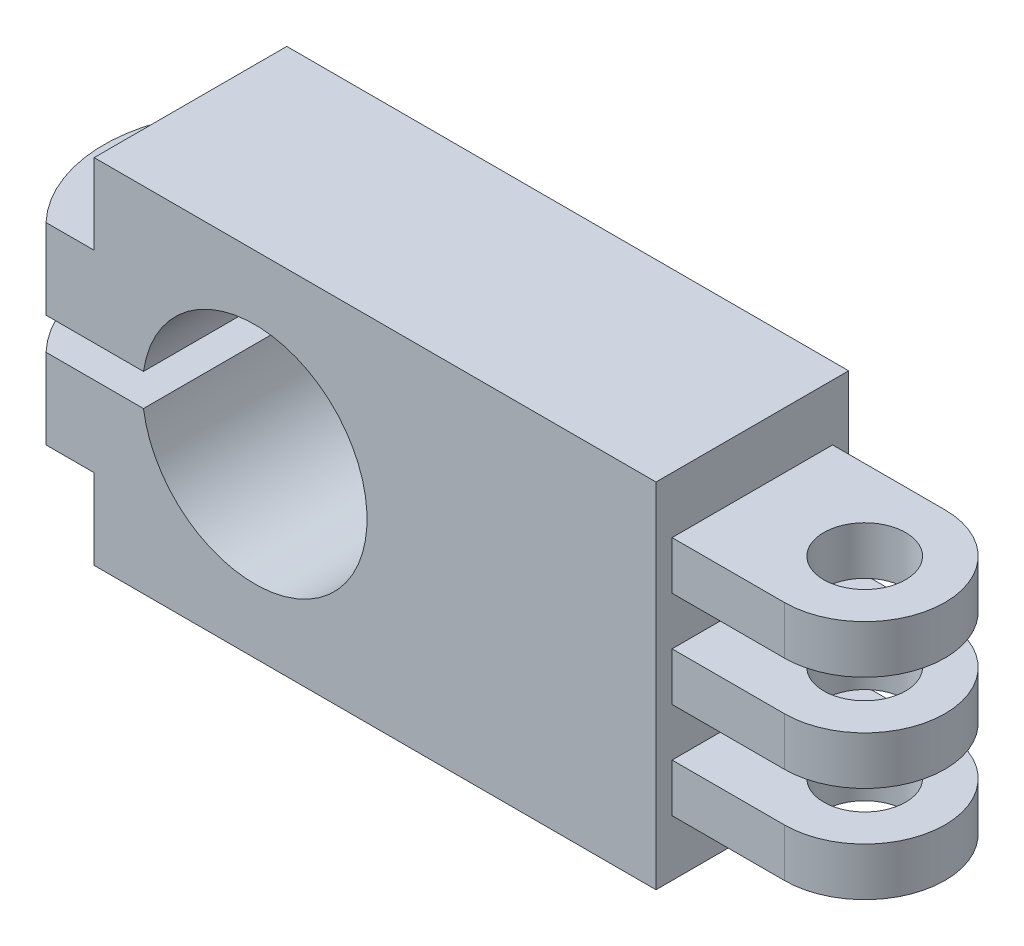
ISO-10303-21;
HEADER;
FILE_DESCRIPTION(('STEP AP214'),'2;1');
FILE_NAME('part.step','',(''),(''),'','','');
FILE_SCHEMA(('AUTOMOTIVE_DESIGN { 1 0 10303 214 1 1 1 1 }'));
ENDSEC;
DATA;
#1=APPLICATION_CONTEXT('core data for automotive mechanical design processes');
#2=APPLICATION_PROTOCOL_DEFINITION('international standard','automotive_design',2000,#1);
#3=PRODUCT_CONTEXT('',#1,'mechanical');
#4=PRODUCT('Part','Part','',(#3));
#5=PRODUCT_RELATED_PRODUCT_CATEGORY('part','',(#4));
#6=PRODUCT_DEFINITION_FORMATION('','',#4);
#7=PRODUCT_DEFINITION_CONTEXT('part definition',#1,'design');
#8=PRODUCT_DEFINITION('design','',#6,#7);
#9=PRODUCT_DEFINITION_SHAPE('','',#8);
#10=(LENGTH_UNIT() NAMED_UNIT(*) SI_UNIT(.MILLI.,.METRE.));
#11=(NAMED_UNIT(*) PLANE_ANGLE_UNIT() SI_UNIT($,.RADIAN.));
#12=(NAMED_UNIT(*) SI_UNIT($,.STERADIAN.) SOLID_ANGLE_UNIT());
#13=UNCERTAINTY_MEASURE_WITH_UNIT(LENGTH_MEASURE(1.E-05),#10,'distance_accuracy_value','');
#14=(GEOMETRIC_REPRESENTATION_CONTEXT(3) GLOBAL_UNCERTAINTY_ASSIGNED_CONTEXT((#13)) GLOBAL_UNIT_ASSIGNED_CONTEXT((#10,
#11,#12)) REPRESENTATION_CONTEXT('',''));
#15=CARTESIAN_POINT('',(0.,0.,0.));
#16=DIRECTION('',(0.,0.,1.));
#17=DIRECTION('',(1.,0.,0.));
#18=AXIS2_PLACEMENT_3D('',#15,#16,#17);
#19=CARTESIAN_POINT('',(-10.,-5.,12.));
#20=DIRECTION('',(0.,1.,0.));
#21=DIRECTION('',(0.,0.,1.));
#22=AXIS2_PLACEMENT_3D('',#19,#20,#21);
#23=PLANE('',#22);
#24=CARTESIAN_POINT('',(-2.5,-5.,6.));
#25=DIRECTION('',(0.,1.,0.));
#26=DIRECTION('',(0.,0.,1.));
#27=AXIS2_PLACEMENT_3D('',#24,#25,#26);
#28=CIRCLE('',#27,1.);
#29=CARTESIAN_POINT('',(-2.5,-5.,7.));
#30=VERTEX_POINT('',#29);
#31=EDGE_CURVE('E323',#30,#30,#28,.T.);
#32=ORIENTED_EDGE('',*,*,#31,.F.);
#33=EDGE_LOOP('',(#32));
#34=FACE_BOUND('',#33,.T.);
#35=CARTESIAN_POINT('',(3.31673634690876,-5.,6.));
#36=DIRECTION('',(0.,-1.,0.));
#37=DIRECTION('',(0.,0.,1.));
#38=AXIS2_PLACEMENT_3D('',#35,#36,#37);
#39=CIRCLE('',#38,8.71212706957137);
#40=CARTESIAN_POINT('',(-3.,-5.,12.));
#41=VERTEX_POINT('',#40);
#42=CARTESIAN_POINT('',(-3.,-5.,0.));
#43=VERTEX_POINT('',#42);
#44=EDGE_CURVE('E47',#41,#43,#39,.T.);
#45=ORIENTED_EDGE('',*,*,#44,.F.);
#46=DIRECTION('',(1.,0.,0.));
#47=VECTOR('',#46,1.);
#48=CARTESIAN_POINT('',(-10.,-5.,12.));
#49=LINE('',#48,#47);
#50=CARTESIAN_POINT('',(0.,-5.,12.));
#51=VERTEX_POINT('',#50);
#52=EDGE_CURVE('E202',#41,#51,#49,.T.);
#53=ORIENTED_EDGE('',*,*,#52,.T.);
#54=DIRECTION('',(0.,0.,-1.));
#55=VECTOR('',#54,1.);
#56=CARTESIAN_POINT('',(0.,-5.,12.));
#57=LINE('',#56,#55);
#58=CARTESIAN_POINT('',(0.,-5.,0.));
#59=VERTEX_POINT('',#58);
#60=EDGE_CURVE('E240',#51,#59,#57,.T.);
#61=ORIENTED_EDGE('',*,*,#60,.T.);
#62=DIRECTION('',(1.,0.,0.));
#63=VECTOR('',#62,1.);
#64=CARTESIAN_POINT('',(-10.,-5.,0.));
#65=LINE('',#64,#63);
#66=EDGE_CURVE('E204',#43,#59,#65,.T.);
#67=ORIENTED_EDGE('',*,*,#66,.F.);
#68=EDGE_LOOP('',(#45,#53,#61,#67));
#69=FACE_BOUND('',#68,.T.);
#70=ADVANCED_FACE('F33',(#34,#69),#23,.T.);
#71=CARTESIAN_POINT('',(-10.,-10.,12.));
#72=DIRECTION('',(0.,1.,0.));
#73=DIRECTION('',(0.,0.,1.));
#74=AXIS2_PLACEMENT_3D('',#71,#72,#73);
#75=PLANE('',#74);
#76=CARTESIAN_POINT('',(-2.5,-10.,6.));
#77=DIRECTION('',(0.,1.,0.));
#78=DIRECTION('',(0.,0.,1.));
#79=AXIS2_PLACEMENT_3D('',#76,#77,#78);
#80=CIRCLE('',#79,1.);
#81=CARTESIAN_POINT('',(-2.5,-10.,7.));
#82=VERTEX_POINT('',#81);
#83=EDGE_CURVE('E320',#82,#82,#80,.T.);
#84=ORIENTED_EDGE('',*,*,#83,.T.);
#85=EDGE_LOOP('',(#84));
#86=FACE_BOUND('',#85,.T.);
#87=DIRECTION('',(1.,0.,0.));
#88=VECTOR('',#87,1.);
#89=CARTESIAN_POINT('',(-10.,-10.,12.));
#90=LINE('',#89,#88);
#91=CARTESIAN_POINT('',(-3.,-10.,12.));
#92=VERTEX_POINT('',#91);
#93=CARTESIAN_POINT('',(3.07179676972449,-10.,12.));
#94=VERTEX_POINT('',#93);
#95=EDGE_CURVE('E238',#92,#94,#90,.T.);
#96=ORIENTED_EDGE('',*,*,#95,.F.);
#97=CARTESIAN_POINT('',(3.31673634690876,-10.,6.));
#98=DIRECTION('',(0.,1.,0.));
#99=DIRECTION('',(0.,0.,1.));
#100=AXIS2_PLACEMENT_3D('',#97,#98,#99);
#101=CIRCLE('',#100,8.71212706957137);
#102=CARTESIAN_POINT('',(-3.,-10.,0.));
#103=VERTEX_POINT('',#102);
#104=EDGE_CURVE('E193',#92,#103,#101,.F.);
#105=ORIENTED_EDGE('',*,*,#104,.T.);
#106=DIRECTION('',(1.,0.,0.));
#107=VECTOR('',#106,1.);
#108=CARTESIAN_POINT('',(-10.,-10.,0.));
#109=LINE('',#108,#107);
#110=CARTESIAN_POINT('',(3.07179676972449,-10.,0.));
#111=VERTEX_POINT('',#110);
#112=EDGE_CURVE('E212',#103,#111,#109,.T.);
#113=ORIENTED_EDGE('',*,*,#112,.T.);
#114=DIRECTION('',(0.,0.,1.));
#115=VECTOR('',#114,1.);
#116=CARTESIAN_POINT('',(3.07179676972449,-10.,-7.));
#117=LINE('',#116,#115);
#118=EDGE_CURVE('E312',#111,#94,#117,.T.);
#119=ORIENTED_EDGE('',*,*,#118,.T.);
#120=EDGE_LOOP('',(#96,#105,#113,#119));
#121=FACE_BOUND('',#120,.T.);
#122=ADVANCED_FACE('F298',(#86,#121),#75,.F.);
#123=CARTESIAN_POINT('',(0.,-12.,12.));
#124=DIRECTION('',(0.,-1.,0.));
#125=DIRECTION('',(0.,0.,-1.));
#126=AXIS2_PLACEMENT_3D('',#123,#124,#125);
#127=PLANE('',#126);
#128=CARTESIAN_POINT('',(-2.5,-12.,6.));
#129=DIRECTION('',(0.,-1.,0.));
#130=DIRECTION('',(0.,0.,-1.));
#131=AXIS2_PLACEMENT_3D('',#128,#129,#130);
#132=CIRCLE('',#131,1.);
#133=CARTESIAN_POINT('',(-2.5,-12.,5.));
#134=VERTEX_POINT('',#133);
#135=EDGE_CURVE('E317',#134,#134,#132,.T.);
#136=ORIENTED_EDGE('',*,*,#135,.T.);
#137=EDGE_LOOP('',(#136));
#138=FACE_BOUND('',#137,.T.);
#139=DIRECTION('',(-1.,0.,0.));
#140=VECTOR('',#139,1.);
#141=CARTESIAN_POINT('',(0.,-12.,0.));
#142=LINE('',#141,#140);
#143=CARTESIAN_POINT('',(3.07179676972449,-12.,0.));
#144=VERTEX_POINT('',#143);
#145=CARTESIAN_POINT('',(-3.,-12.,0.));
#146=VERTEX_POINT('',#145);
#147=EDGE_CURVE('E216',#144,#146,#142,.T.);
#148=ORIENTED_EDGE('',*,*,#147,.T.);
#149=CARTESIAN_POINT('',(3.31673634690876,-12.,6.));
#150=DIRECTION('',(0.,-1.,0.));
#151=DIRECTION('',(0.,0.,-1.));
#152=AXIS2_PLACEMENT_3D('',#149,#150,#151);
#153=CIRCLE('',#152,8.71212706957137);
#154=CARTESIAN_POINT('',(-3.,-12.,12.));
#155=VERTEX_POINT('',#154);
#156=EDGE_CURVE('E55',#146,#155,#153,.F.);
#157=ORIENTED_EDGE('',*,*,#156,.T.);
#158=DIRECTION('',(-1.,0.,0.));
#159=VECTOR('',#158,1.);
#160=CARTESIAN_POINT('',(0.,-12.,12.));
#161=LINE('',#160,#159);
#162=CARTESIAN_POINT('',(3.07179676972449,-12.,12.));
#163=VERTEX_POINT('',#162);
#164=EDGE_CURVE('E235',#163,#155,#161,.T.);
#165=ORIENTED_EDGE('',*,*,#164,.F.);
#166=DIRECTION('',(0.,0.,1.));
#167=VECTOR('',#166,1.);
#168=CARTESIAN_POINT('',(3.07179676972449,-12.,-7.));
#169=LINE('',#168,#167);
#170=EDGE_CURVE('E304',#163,#144,#169,.F.);
#171=ORIENTED_EDGE('',*,*,#170,.T.);
#172=EDGE_LOOP('',(#148,#157,#165,#171));
#173=FACE_BOUND('',#172,.T.);
#174=ADVANCED_FACE('F424',(#138,#173),#127,.F.);
#175=CARTESIAN_POINT('',(0.,-17.,12.));
#176=DIRECTION('',(0.,-1.,0.));
#177=DIRECTION('',(0.,0.,-1.));
#178=AXIS2_PLACEMENT_3D('',#175,#176,#177);
#179=PLANE('',#178);
#180=CARTESIAN_POINT('',(-2.5,-17.,6.));
#181=DIRECTION('',(0.,-1.,0.));
#182=DIRECTION('',(0.,0.,-1.));
#183=AXIS2_PLACEMENT_3D('',#180,#181,#182);
#184=CIRCLE('',#183,1.);
#185=CARTESIAN_POINT('',(-2.5,-17.,5.));
#186=VERTEX_POINT('',#185);
#187=EDGE_CURVE('E314',#186,#186,#184,.T.);
#188=ORIENTED_EDGE('',*,*,#187,.F.);
#189=EDGE_LOOP('',(#188));
#190=FACE_BOUND('',#189,.T.);
#191=CARTESIAN_POINT('',(3.31673634690876,-17.,6.));
#192=DIRECTION('',(0.,-1.,0.));
#193=DIRECTION('',(0.,0.,-1.));
#194=AXIS2_PLACEMENT_3D('',#191,#192,#193);
#195=CIRCLE('',#194,8.71212706957137);
#196=CARTESIAN_POINT('',(-3.,-17.,0.));
#197=VERTEX_POINT('',#196);
#198=CARTESIAN_POINT('',(-3.,-17.,12.));
#199=VERTEX_POINT('',#198);
#200=EDGE_CURVE('E306',#197,#199,#195,.F.);
#201=ORIENTED_EDGE('',*,*,#200,.F.);
#202=DIRECTION('',(-1.,0.,0.));
#203=VECTOR('',#202,1.);
#204=CARTESIAN_POINT('',(0.,-17.,0.));
#205=LINE('',#204,#203);
#206=CARTESIAN_POINT('',(0.,-17.,0.));
#207=VERTEX_POINT('',#206);
#208=EDGE_CURVE('E257',#207,#197,#205,.T.);
#209=ORIENTED_EDGE('',*,*,#208,.F.);
#210=DIRECTION('',(0.,0.,-1.));
#211=VECTOR('',#210,1.);
#212=CARTESIAN_POINT('',(0.,-17.,12.));
#213=LINE('',#212,#211);
#214=CARTESIAN_POINT('',(0.,-17.,12.));
#215=VERTEX_POINT('',#214);
#216=EDGE_CURVE('E262',#215,#207,#213,.T.);
#217=ORIENTED_EDGE('',*,*,#216,.F.);
#218=DIRECTION('',(-1.,0.,0.));
#219=VECTOR('',#218,1.);
#220=CARTESIAN_POINT('',(0.,-17.,12.));
#221=LINE('',#220,#219);
#222=EDGE_CURVE('E232',#215,#199,#221,.T.);
#223=ORIENTED_EDGE('',*,*,#222,.T.);
#224=EDGE_LOOP('',(#201,#209,#217,#223));
#225=FACE_BOUND('',#224,.T.);
#226=ADVANCED_FACE('F475',(#190,#225),#179,.T.);
#227=CARTESIAN_POINT('',(0.,-22.,12.));
#228=DIRECTION('',(-1.,0.,0.));
#229=DIRECTION('',(0.,0.,1.));
#230=AXIS2_PLACEMENT_3D('',#227,#228,#229);
#231=PLANE('',#230);
#232=DIRECTION('',(0.,1.,0.));
#233=VECTOR('',#232,1.);
#234=CARTESIAN_POINT('',(0.,-22.,0.));
#235=LINE('',#234,#233);
#236=CARTESIAN_POINT('',(0.,-22.,0.));
#237=VERTEX_POINT('',#236);
#238=EDGE_CURVE('E254',#237,#207,#235,.T.);
#239=ORIENTED_EDGE('',*,*,#238,.F.);
#240=DIRECTION('',(0.,0.,-1.));
#241=VECTOR('',#240,1.);
#242=CARTESIAN_POINT('',(0.,-22.,12.));
#243=LINE('',#242,#241);
#244=CARTESIAN_POINT('',(0.,-22.,12.));
#245=VERTEX_POINT('',#244);
#246=EDGE_CURVE('E265',#245,#237,#243,.T.);
#247=ORIENTED_EDGE('',*,*,#246,.F.);
#248=DIRECTION('',(0.,1.,0.));
#249=VECTOR('',#248,1.);
#250=CARTESIAN_POINT('',(0.,-22.,12.));
#251=LINE('',#250,#249);
#252=EDGE_CURVE('E229',#245,#215,#251,.T.);
#253=ORIENTED_EDGE('',*,*,#252,.T.);
#254=ORIENTED_EDGE('',*,*,#216,.T.);
#255=EDGE_LOOP('',(#239,#247,#253,#254));
#256=FACE_BOUND('',#255,.T.);
#257=ADVANCED_FACE('F479',(#256),#231,.T.);
#258=CARTESIAN_POINT('',(35.,-22.,12.));
#259=DIRECTION('',(0.,-1.,0.));
#260=DIRECTION('',(0.,0.,-1.));
#261=AXIS2_PLACEMENT_3D('',#258,#259,#260);
#262=PLANE('',#261);
#263=DIRECTION('',(-1.,0.,0.));
#264=VECTOR('',#263,1.);
#265=CARTESIAN_POINT('',(35.,-22.,0.));
#266=LINE('',#265,#264);
#267=CARTESIAN_POINT('',(35.,-22.,0.));
#268=VERTEX_POINT('',#267);
#269=EDGE_CURVE('E251',#268,#237,#266,.T.);
#270=ORIENTED_EDGE('',*,*,#269,.F.);
#271=DIRECTION('',(0.,0.,-1.));
#272=VECTOR('',#271,1.);
#273=CARTESIAN_POINT('',(35.,-22.,12.));
#274=LINE('',#273,#272);
#275=CARTESIAN_POINT('',(35.,-22.,12.));
#276=VERTEX_POINT('',#275);
#277=EDGE_CURVE('E267',#276,#268,#274,.T.);
#278=ORIENTED_EDGE('',*,*,#277,.F.);
#279=DIRECTION('',(-1.,0.,0.));
#280=VECTOR('',#279,1.);
#281=CARTESIAN_POINT('',(35.,-22.,12.));
#282=LINE('',#281,#280);
#283=EDGE_CURVE('E226',#276,#245,#282,.T.);
#284=ORIENTED_EDGE('',*,*,#283,.T.);
#285=ORIENTED_EDGE('',*,*,#246,.T.);
#286=EDGE_LOOP('',(#270,#278,#284,#285));
#287=FACE_BOUND('',#286,.T.);
#288=ADVANCED_FACE('F415',(#287),#262,.T.);
#289=CARTESIAN_POINT('',(35.,-18.5,12.));
#290=DIRECTION('',(1.,0.,0.));
#291=DIRECTION('',(0.,0.,-1.));
#292=AXIS2_PLACEMENT_3D('',#289,#290,#291);
#293=PLANE('',#292);
#294=ORIENTED_EDGE('',*,*,#277,.T.);
#295=DIRECTION('',(0.,-1.,0.));
#296=VECTOR('',#295,1.);
#297=CARTESIAN_POINT('',(35.,-18.5,0.));
#298=LINE('',#297,#296);
#299=CARTESIAN_POINT('',(35.,0.,0.));
#300=VERTEX_POINT('',#299);
#301=EDGE_CURVE('E248',#300,#268,#298,.T.);
#302=ORIENTED_EDGE('',*,*,#301,.F.);
#303=DIRECTION('',(0.,0.,-1.));
#304=VECTOR('',#303,1.);
#305=CARTESIAN_POINT('',(35.,0.,12.));
#306=LINE('',#305,#304);
#307=CARTESIAN_POINT('',(35.,0.,12.));
#308=VERTEX_POINT('',#307);
#309=EDGE_CURVE('E287',#308,#300,#306,.T.);
#310=ORIENTED_EDGE('',*,*,#309,.F.);
#311=DIRECTION('',(0.,-1.,0.));
#312=VECTOR('',#311,1.);
#313=CARTESIAN_POINT('',(35.,0.,12.));
#314=LINE('',#313,#312);
#315=EDGE_CURVE('E224',#308,#276,#314,.T.);
#316=ORIENTED_EDGE('',*,*,#315,.T.);
#317=EDGE_LOOP('',(#294,#302,#310,#316));
#318=FACE_BOUND('',#317,.T.);
#319=DIRECTION('',(0.,1.,0.));
#320=VECTOR('',#319,1.);
#321=CARTESIAN_POINT('',(35.,-22.5,1.));
#322=LINE('',#321,#320);
#323=CARTESIAN_POINT('',(35.,-18.5,1.));
#324=VERTEX_POINT('',#323);
#325=CARTESIAN_POINT('',(35.,-15.5,1.));
#326=VERTEX_POINT('',#325);
#327=EDGE_CURVE('E340',#324,#326,#322,.T.);
#328=ORIENTED_EDGE('',*,*,#327,.F.);
#329=DIRECTION('',(0.,0.,-1.));
#330=VECTOR('',#329,1.);
#331=CARTESIAN_POINT('',(35.,-18.5,12.));
#332=LINE('',#331,#330);
#333=CARTESIAN_POINT('',(35.,-18.5,11.));
#334=VERTEX_POINT('',#333);
#335=EDGE_CURVE('E269',#334,#324,#332,.T.);
#336=ORIENTED_EDGE('',*,*,#335,.F.);
#337=DIRECTION('',(0.,1.,0.));
#338=VECTOR('',#337,1.);
#339=CARTESIAN_POINT('',(35.,-22.5,11.));
#340=LINE('',#339,#338);
#341=CARTESIAN_POINT('',(35.,-15.5,11.));
#342=VERTEX_POINT('',#341);
#343=EDGE_CURVE('E345',#334,#342,#340,.T.);
#344=ORIENTED_EDGE('',*,*,#343,.T.);
#345=DIRECTION('',(0.,0.,-1.));
#346=VECTOR('',#345,1.);
#347=CARTESIAN_POINT('',(35.,-15.5,12.));
#348=LINE('',#347,#346);
#349=EDGE_CURVE('E272',#342,#326,#348,.T.);
#350=ORIENTED_EDGE('',*,*,#349,.T.);
#351=EDGE_LOOP('',(#328,#336,#344,#350));
#352=FACE_BOUND('',#351,.T.);
#353=CARTESIAN_POINT('',(35.,-12.5,1.));
#354=VERTEX_POINT('',#353);
#355=CARTESIAN_POINT('',(35.,-9.5,1.));
#356=VERTEX_POINT('',#355);
#357=EDGE_CURVE('E344',#354,#356,#322,.T.);
#358=ORIENTED_EDGE('',*,*,#357,.F.);
#359=DIRECTION('',(0.,0.,-1.));
#360=VECTOR('',#359,1.);
#361=CARTESIAN_POINT('',(35.,-12.5,12.));
#362=LINE('',#361,#360);
#363=CARTESIAN_POINT('',(35.,-12.5,11.));
#364=VERTEX_POINT('',#363);
#365=EDGE_CURVE('E275',#364,#354,#362,.T.);
#366=ORIENTED_EDGE('',*,*,#365,.F.);
#367=CARTESIAN_POINT('',(35.,-9.5,11.));
#368=VERTEX_POINT('',#367);
#369=EDGE_CURVE('E348',#364,#368,#340,.T.);
#370=ORIENTED_EDGE('',*,*,#369,.T.);
#371=DIRECTION('',(0.,0.,-1.));
#372=VECTOR('',#371,1.);
#373=CARTESIAN_POINT('',(35.,-9.5,12.));
#374=LINE('',#373,#372);
#375=EDGE_CURVE('E278',#368,#356,#374,.T.);
#376=ORIENTED_EDGE('',*,*,#375,.T.);
#377=EDGE_LOOP('',(#358,#366,#370,#376));
#378=FACE_BOUND('',#377,.T.);
#379=CARTESIAN_POINT('',(35.,-6.5,1.));
#380=VERTEX_POINT('',#379);
#381=CARTESIAN_POINT('',(35.,-3.5,1.));
#382=VERTEX_POINT('',#381);
#383=EDGE_CURVE('E342',#380,#382,#322,.T.);
#384=ORIENTED_EDGE('',*,*,#383,.F.);
#385=DIRECTION('',(0.,0.,-1.));
#386=VECTOR('',#385,1.);
#387=CARTESIAN_POINT('',(35.,-6.5,12.));
#388=LINE('',#387,#386);
#389=CARTESIAN_POINT('',(35.,-6.5,11.));
#390=VERTEX_POINT('',#389);
#391=EDGE_CURVE('E281',#390,#380,#388,.T.);
#392=ORIENTED_EDGE('',*,*,#391,.F.);
#393=CARTESIAN_POINT('',(35.,-3.5,11.));
#394=VERTEX_POINT('',#393);
#395=EDGE_CURVE('E346',#390,#394,#340,.T.);
#396=ORIENTED_EDGE('',*,*,#395,.T.);
#397=DIRECTION('',(0.,0.,-1.));
#398=VECTOR('',#397,1.);
#399=CARTESIAN_POINT('',(35.,-3.5,12.));
#400=LINE('',#399,#398);
#401=EDGE_CURVE('E284',#394,#382,#400,.T.);
#402=ORIENTED_EDGE('',*,*,#401,.T.);
#403=EDGE_LOOP('',(#384,#392,#396,#402));
#404=FACE_BOUND('',#403,.T.);
#405=ADVANCED_FACE('F405',(#318,#352,#378,#404),#293,.T.);
#406=CARTESIAN_POINT('',(47.,-18.5,12.));
#407=DIRECTION('',(0.,-1.,0.));
#408=DIRECTION('',(0.,0.,-1.));
#409=AXIS2_PLACEMENT_3D('',#406,#407,#408);
#410=PLANE('',#409);
#411=DIRECTION('',(-1.,0.,0.));
#412=VECTOR('',#411,1.);
#413=CARTESIAN_POINT('',(47.,-18.5,1.));
#414=LINE('',#413,#412);
#415=CARTESIAN_POINT('',(42.,-18.5,1.));
#416=VERTEX_POINT('',#415);
#417=EDGE_CURVE('E370',#416,#324,#414,.T.);
#418=ORIENTED_EDGE('',*,*,#417,.F.);
#419=CARTESIAN_POINT('',(42.,-18.5,6.));
#420=DIRECTION('',(0.,-1.,0.));
#421=DIRECTION('',(0.,0.,-1.));
#422=AXIS2_PLACEMENT_3D('',#419,#420,#421);
#423=CIRCLE('',#422,5.);
#424=CARTESIAN_POINT('',(42.,-18.5,11.));
#425=VERTEX_POINT('',#424);
#426=EDGE_CURVE('E380',#425,#416,#423,.F.);
#427=ORIENTED_EDGE('',*,*,#426,.F.);
#428=DIRECTION('',(1.,0.,0.));
#429=VECTOR('',#428,1.);
#430=CARTESIAN_POINT('',(47.,-18.5,11.));
#431=LINE('',#430,#429);
#432=EDGE_CURVE('E360',#334,#425,#431,.T.);
#433=ORIENTED_EDGE('',*,*,#432,.F.);
#434=ORIENTED_EDGE('',*,*,#335,.T.);
#435=EDGE_LOOP('',(#418,#427,#433,#434));
#436=FACE_BOUND('',#435,.T.);
#437=CARTESIAN_POINT('',(42.,-18.5,6.));
#438=DIRECTION('',(0.,-1.,0.));
#439=DIRECTION('',(0.,0.,-1.));
#440=AXIS2_PLACEMENT_3D('',#437,#438,#439);
#441=CIRCLE('',#440,2.55);
#442=CARTESIAN_POINT('',(42.,-18.5,3.45));
#443=VERTEX_POINT('',#442);
#444=EDGE_CURVE('E219',#443,#443,#441,.T.);
#445=ORIENTED_EDGE('',*,*,#444,.F.);
#446=EDGE_LOOP('',(#445));
#447=FACE_BOUND('',#446,.T.);
#448=ADVANCED_FACE('F402',(#436,#447),#410,.T.);
#449=CARTESIAN_POINT('',(35.,-15.5,12.));
#450=DIRECTION('',(0.,1.,0.));
#451=DIRECTION('',(0.,0.,1.));
#452=AXIS2_PLACEMENT_3D('',#449,#450,#451);
#453=PLANE('',#452);
#454=DIRECTION('',(1.,0.,0.));
#455=VECTOR('',#454,1.);
#456=CARTESIAN_POINT('',(35.,-15.5,1.));
#457=LINE('',#456,#455);
#458=CARTESIAN_POINT('',(42.,-15.5,1.));
#459=VERTEX_POINT('',#458);
#460=EDGE_CURVE('E368',#326,#459,#457,.T.);
#461=ORIENTED_EDGE('',*,*,#460,.F.);
#462=ORIENTED_EDGE('',*,*,#349,.F.);
#463=DIRECTION('',(-1.,0.,0.));
#464=VECTOR('',#463,1.);
#465=CARTESIAN_POINT('',(35.,-15.5,11.));
#466=LINE('',#465,#464);
#467=CARTESIAN_POINT('',(42.,-15.5,11.));
#468=VERTEX_POINT('',#467);
#469=EDGE_CURVE('E358',#468,#342,#466,.T.);
#470=ORIENTED_EDGE('',*,*,#469,.F.);
#471=CARTESIAN_POINT('',(42.,-15.5,6.));
#472=DIRECTION('',(0.,1.,0.));
#473=DIRECTION('',(0.,0.,1.));
#474=AXIS2_PLACEMENT_3D('',#471,#472,#473);
#475=CIRCLE('',#474,5.);
#476=EDGE_CURVE('E378',#459,#468,#475,.F.);
#477=ORIENTED_EDGE('',*,*,#476,.F.);
#478=EDGE_LOOP('',(#461,#462,#470,#477));
#479=FACE_BOUND('',#478,.T.);
#480=CARTESIAN_POINT('',(42.,-15.5,6.));
#481=DIRECTION('',(0.,1.,0.));
#482=DIRECTION('',(0.,0.,1.));
#483=AXIS2_PLACEMENT_3D('',#480,#481,#482);
#484=CIRCLE('',#483,2.55);
#485=CARTESIAN_POINT('',(42.,-15.5,8.55));
#486=VERTEX_POINT('',#485);
#487=EDGE_CURVE('E393',#486,#486,#484,.T.);
#488=ORIENTED_EDGE('',*,*,#487,.F.);
#489=EDGE_LOOP('',(#488));
#490=FACE_BOUND('',#489,.T.);
#491=ADVANCED_FACE('F404',(#479,#490),#453,.T.);
#492=CARTESIAN_POINT('',(47.,-12.5,12.));
#493=DIRECTION('',(0.,-1.,0.));
#494=DIRECTION('',(0.,0.,-1.));
#495=AXIS2_PLACEMENT_3D('',#492,#493,#494);
#496=PLANE('',#495);
#497=DIRECTION('',(-1.,0.,0.));
#498=VECTOR('',#497,1.);
#499=CARTESIAN_POINT('',(47.,-12.5,1.));
#500=LINE('',#499,#498);
#501=CARTESIAN_POINT('',(42.,-12.5,1.));
#502=VERTEX_POINT('',#501);
#503=EDGE_CURVE('E366',#502,#354,#500,.T.);
#504=ORIENTED_EDGE('',*,*,#503,.F.);
#505=CARTESIAN_POINT('',(42.,-12.5,6.));
#506=DIRECTION('',(0.,-1.,0.));
#507=DIRECTION('',(0.,0.,-1.));
#508=AXIS2_PLACEMENT_3D('',#505,#506,#507);
#509=CIRCLE('',#508,5.);
#510=CARTESIAN_POINT('',(42.,-12.5,11.));
#511=VERTEX_POINT('',#510);
#512=EDGE_CURVE('E376',#511,#502,#509,.F.);
#513=ORIENTED_EDGE('',*,*,#512,.F.);
#514=DIRECTION('',(1.,0.,0.));
#515=VECTOR('',#514,1.);
#516=CARTESIAN_POINT('',(47.,-12.5,11.));
#517=LINE('',#516,#515);
#518=EDGE_CURVE('E356',#364,#511,#517,.T.);
#519=ORIENTED_EDGE('',*,*,#518,.F.);
#520=ORIENTED_EDGE('',*,*,#365,.T.);
#521=EDGE_LOOP('',(#504,#513,#519,#520));
#522=FACE_BOUND('',#521,.T.);
#523=CARTESIAN_POINT('',(42.,-12.5,6.));
#524=DIRECTION('',(0.,-1.,0.));
#525=DIRECTION('',(0.,0.,-1.));
#526=AXIS2_PLACEMENT_3D('',#523,#524,#525);
#527=CIRCLE('',#526,2.55);
#528=CARTESIAN_POINT('',(42.,-12.5,3.45));
#529=VERTEX_POINT('',#528);
#530=EDGE_CURVE('E391',#529,#529,#527,.T.);
#531=ORIENTED_EDGE('',*,*,#530,.F.);
#532=EDGE_LOOP('',(#531));
#533=FACE_BOUND('',#532,.T.);
#534=ADVANCED_FACE('F412',(#522,#533),#496,.T.);
#535=CARTESIAN_POINT('',(35.,-9.5,12.));
#536=DIRECTION('',(0.,1.,0.));
#537=DIRECTION('',(0.,0.,1.));
#538=AXIS2_PLACEMENT_3D('',#535,#536,#537);
#539=PLANE('',#538);
#540=DIRECTION('',(1.,0.,0.));
#541=VECTOR('',#540,1.);
#542=CARTESIAN_POINT('',(35.,-9.5,1.));
#543=LINE('',#542,#541);
#544=CARTESIAN_POINT('',(42.,-9.5,1.));
#545=VERTEX_POINT('',#544);
#546=EDGE_CURVE('E364',#356,#545,#543,.T.);
#547=ORIENTED_EDGE('',*,*,#546,.F.);
#548=ORIENTED_EDGE('',*,*,#375,.F.);
#549=DIRECTION('',(-1.,0.,0.));
#550=VECTOR('',#549,1.);
#551=CARTESIAN_POINT('',(35.,-9.5,11.));
#552=LINE('',#551,#550);
#553=CARTESIAN_POINT('',(42.,-9.5,11.));
#554=VERTEX_POINT('',#553);
#555=EDGE_CURVE('E354',#554,#368,#552,.T.);
#556=ORIENTED_EDGE('',*,*,#555,.F.);
#557=CARTESIAN_POINT('',(42.,-9.5,6.));
#558=DIRECTION('',(0.,1.,0.));
#559=DIRECTION('',(0.,0.,1.));
#560=AXIS2_PLACEMENT_3D('',#557,#558,#559);
#561=CIRCLE('',#560,5.);
#562=EDGE_CURVE('E374',#545,#554,#561,.F.);
#563=ORIENTED_EDGE('',*,*,#562,.F.);
#564=EDGE_LOOP('',(#547,#548,#556,#563));
#565=FACE_BOUND('',#564,.T.);
#566=CARTESIAN_POINT('',(42.,-9.5,6.));
#567=DIRECTION('',(0.,1.,0.));
#568=DIRECTION('',(0.,0.,1.));
#569=AXIS2_PLACEMENT_3D('',#566,#567,#568);
#570=CIRCLE('',#569,2.55);
#571=CARTESIAN_POINT('',(42.,-9.5,8.55));
#572=VERTEX_POINT('',#571);
#573=EDGE_CURVE('E388',#572,#572,#570,.T.);
#574=ORIENTED_EDGE('',*,*,#573,.F.);
#575=EDGE_LOOP('',(#574));
#576=FACE_BOUND('',#575,.T.);
#577=ADVANCED_FACE('F512',(#565,#576),#539,.T.);
#578=CARTESIAN_POINT('',(47.,-6.5,12.));
#579=DIRECTION('',(0.,-1.,0.));
#580=DIRECTION('',(0.,0.,-1.));
#581=AXIS2_PLACEMENT_3D('',#578,#579,#580);
#582=PLANE('',#581);
#583=DIRECTION('',(-1.,0.,0.));
#584=VECTOR('',#583,1.);
#585=CARTESIAN_POINT('',(47.,-6.5,1.));
#586=LINE('',#585,#584);
#587=CARTESIAN_POINT('',(42.,-6.5,1.));
#588=VERTEX_POINT('',#587);
#589=EDGE_CURVE('E362',#588,#380,#586,.T.);
#590=ORIENTED_EDGE('',*,*,#589,.F.);
#591=CARTESIAN_POINT('',(42.,-6.5,6.));
#592=DIRECTION('',(0.,-1.,0.));
#593=DIRECTION('',(0.,0.,-1.));
#594=AXIS2_PLACEMENT_3D('',#591,#592,#593);
#595=CIRCLE('',#594,5.);
#596=CARTESIAN_POINT('',(42.,-6.5,11.));
#597=VERTEX_POINT('',#596);
#598=EDGE_CURVE('E372',#597,#588,#595,.F.);
#599=ORIENTED_EDGE('',*,*,#598,.F.);
#600=DIRECTION('',(1.,0.,0.));
#601=VECTOR('',#600,1.);
#602=CARTESIAN_POINT('',(47.,-6.5,11.));
#603=LINE('',#602,#601);
#604=EDGE_CURVE('E352',#390,#597,#603,.T.);
#605=ORIENTED_EDGE('',*,*,#604,.F.);
#606=ORIENTED_EDGE('',*,*,#391,.T.);
#607=EDGE_LOOP('',(#590,#599,#605,#606));
#608=FACE_BOUND('',#607,.T.);
#609=CARTESIAN_POINT('',(42.,-6.5,6.));
#610=DIRECTION('',(0.,-1.,0.));
#611=DIRECTION('',(0.,0.,-1.));
#612=AXIS2_PLACEMENT_3D('',#609,#610,#611);
#613=CIRCLE('',#612,2.55);
#614=CARTESIAN_POINT('',(42.,-6.5,3.45));
#615=VERTEX_POINT('',#614);
#616=EDGE_CURVE('E385',#615,#615,#613,.T.);
#617=ORIENTED_EDGE('',*,*,#616,.F.);
#618=EDGE_LOOP('',(#617));
#619=FACE_BOUND('',#618,.T.);
#620=ADVANCED_FACE('F508',(#608,#619),#582,.T.);
#621=CARTESIAN_POINT('',(35.,-3.5,12.));
#622=DIRECTION('',(0.,1.,0.));
#623=DIRECTION('',(0.,0.,1.));
#624=AXIS2_PLACEMENT_3D('',#621,#622,#623);
#625=PLANE('',#624);
#626=DIRECTION('',(1.,0.,0.));
#627=VECTOR('',#626,1.);
#628=CARTESIAN_POINT('',(42.,-3.5,1.));
#629=LINE('',#628,#627);
#630=CARTESIAN_POINT('',(42.,-3.5,1.));
#631=VERTEX_POINT('',#630);
#632=EDGE_CURVE('E332',#382,#631,#629,.T.);
#633=ORIENTED_EDGE('',*,*,#632,.F.);
#634=ORIENTED_EDGE('',*,*,#401,.F.);
#635=DIRECTION('',(-1.,0.,0.));
#636=VECTOR('',#635,1.);
#637=CARTESIAN_POINT('',(35.,-3.5,11.));
#638=LINE('',#637,#636);
#639=CARTESIAN_POINT('',(42.,-3.5,11.));
#640=VERTEX_POINT('',#639);
#641=EDGE_CURVE('E329',#640,#394,#638,.T.);
#642=ORIENTED_EDGE('',*,*,#641,.F.);
#643=CARTESIAN_POINT('',(42.,-3.5,6.));
#644=DIRECTION('',(0.,-1.,0.));
#645=DIRECTION('',(0.,0.,1.));
#646=AXIS2_PLACEMENT_3D('',#643,#644,#645);
#647=CIRCLE('',#646,5.);
#648=EDGE_CURVE('E326',#631,#640,#647,.T.);
#649=ORIENTED_EDGE('',*,*,#648,.F.);
#650=EDGE_LOOP('',(#633,#634,#642,#649));
#651=FACE_BOUND('',#650,.T.);
#652=CARTESIAN_POINT('',(42.,-3.5,6.));
#653=DIRECTION('',(0.,1.,0.));
#654=DIRECTION('',(0.,0.,1.));
#655=AXIS2_PLACEMENT_3D('',#652,#653,#654);
#656=CIRCLE('',#655,2.55);
#657=CARTESIAN_POINT('',(42.,-3.5,8.55));
#658=VERTEX_POINT('',#657);
#659=EDGE_CURVE('E382',#658,#658,#656,.T.);
#660=ORIENTED_EDGE('',*,*,#659,.F.);
#661=EDGE_LOOP('',(#660));
#662=FACE_BOUND('',#661,.T.);
#663=ADVANCED_FACE('F503',(#651,#662),#625,.T.);
#664=CARTESIAN_POINT('',(0.,0.,12.));
#665=DIRECTION('',(0.,1.,0.));
#666=DIRECTION('',(0.,0.,1.));
#667=AXIS2_PLACEMENT_3D('',#664,#665,#666);
#668=PLANE('',#667);
#669=DIRECTION('',(1.,0.,0.));
#670=VECTOR('',#669,1.);
#671=CARTESIAN_POINT('',(0.,0.,0.));
#672=LINE('',#671,#670);
#673=CARTESIAN_POINT('',(0.,0.,0.));
#674=VERTEX_POINT('',#673);
#675=EDGE_CURVE('E245',#674,#300,#672,.T.);
#676=ORIENTED_EDGE('',*,*,#675,.F.);
#677=DIRECTION('',(0.,0.,-1.));
#678=VECTOR('',#677,1.);
#679=CARTESIAN_POINT('',(0.,0.,12.));
#680=LINE('',#679,#678);
#681=CARTESIAN_POINT('',(0.,0.,12.));
#682=VERTEX_POINT('',#681);
#683=EDGE_CURVE('E290',#682,#674,#680,.T.);
#684=ORIENTED_EDGE('',*,*,#683,.F.);
#685=DIRECTION('',(1.,0.,0.));
#686=VECTOR('',#685,1.);
#687=CARTESIAN_POINT('',(0.,0.,12.));
#688=LINE('',#687,#686);
#689=EDGE_CURVE('E214',#682,#308,#688,.T.);
#690=ORIENTED_EDGE('',*,*,#689,.T.);
#691=ORIENTED_EDGE('',*,*,#309,.T.);
#692=EDGE_LOOP('',(#676,#684,#690,#691));
#693=FACE_BOUND('',#692,.T.);
#694=ADVANCED_FACE('F496',(#693),#668,.T.);
#695=CARTESIAN_POINT('',(0.,-5.,12.));
#696=DIRECTION('',(-1.,0.,0.));
#697=DIRECTION('',(0.,-1.,0.));
#698=AXIS2_PLACEMENT_3D('',#695,#696,#697);
#699=PLANE('',#698);
#700=DIRECTION('',(0.,1.,0.));
#701=VECTOR('',#700,1.);
#702=CARTESIAN_POINT('',(0.,-5.,0.));
#703=LINE('',#702,#701);
#704=EDGE_CURVE('E242',#59,#674,#703,.T.);
#705=ORIENTED_EDGE('',*,*,#704,.F.);
#706=ORIENTED_EDGE('',*,*,#60,.F.);
#707=DIRECTION('',(0.,1.,0.));
#708=VECTOR('',#707,1.);
#709=CARTESIAN_POINT('',(0.,-5.,12.));
#710=LINE('',#709,#708);
#711=EDGE_CURVE('E211',#51,#682,#710,.T.);
#712=ORIENTED_EDGE('',*,*,#711,.T.);
#713=ORIENTED_EDGE('',*,*,#683,.T.);
#714=EDGE_LOOP('',(#705,#706,#712,#713));
#715=FACE_BOUND('',#714,.T.);
#716=ADVANCED_FACE('F470',(#715),#699,.T.);
#717=CARTESIAN_POINT('',(0.,0.,12.));
#718=DIRECTION('',(0.,0.,1.));
#719=DIRECTION('',(1.,0.,0.));
#720=AXIS2_PLACEMENT_3D('',#717,#718,#719);
#721=PLANE('',#720);
#722=DIRECTION('',(0.,1.,0.));
#723=VECTOR('',#722,1.);
#724=CARTESIAN_POINT('',(-3.,-24.,12.));
#725=LINE('',#724,#723);
#726=EDGE_CURVE('E197',#199,#155,#725,.T.);
#727=ORIENTED_EDGE('',*,*,#726,.F.);
#728=ORIENTED_EDGE('',*,*,#222,.F.);
#729=ORIENTED_EDGE('',*,*,#252,.F.);
#730=ORIENTED_EDGE('',*,*,#283,.F.);
#731=ORIENTED_EDGE('',*,*,#315,.F.);
#732=ORIENTED_EDGE('',*,*,#689,.F.);
#733=ORIENTED_EDGE('',*,*,#711,.F.);
#734=ORIENTED_EDGE('',*,*,#52,.F.);
#735=EDGE_CURVE('E190',#92,#41,#725,.T.);
#736=ORIENTED_EDGE('',*,*,#735,.F.);
#737=ORIENTED_EDGE('',*,*,#95,.T.);
#738=CARTESIAN_POINT('',(10.,-11.,12.));
#739=DIRECTION('',(0.,0.,1.));
#740=DIRECTION('',(1.,0.,0.));
#741=AXIS2_PLACEMENT_3D('',#738,#739,#740);
#742=CIRCLE('',#741,7.);
#743=EDGE_CURVE('E301',#163,#94,#742,.T.);
#744=ORIENTED_EDGE('',*,*,#743,.F.);
#745=ORIENTED_EDGE('',*,*,#164,.T.);
#746=EDGE_LOOP('',(#727,#728,#729,#730,#731,#732,#733,#734,#736,#737,#744,#745));
#747=FACE_BOUND('',#746,.T.);
#748=ADVANCED_FACE('F208',(#747),#721,.T.);
#749=CARTESIAN_POINT('',(0.,0.,0.));
#750=DIRECTION('',(0.,0.,1.));
#751=DIRECTION('',(1.,0.,0.));
#752=AXIS2_PLACEMENT_3D('',#749,#750,#751);
#753=PLANE('',#752);
#754=ORIENTED_EDGE('',*,*,#208,.T.);
#755=DIRECTION('',(0.,1.,0.));
#756=VECTOR('',#755,1.);
#757=CARTESIAN_POINT('',(-3.,0.,0.));
#758=LINE('',#757,#756);
#759=EDGE_CURVE('E11',#197,#146,#758,.T.);
#760=ORIENTED_EDGE('',*,*,#759,.T.);
#761=ORIENTED_EDGE('',*,*,#147,.F.);
#762=CARTESIAN_POINT('',(10.,-11.,0.));
#763=DIRECTION('',(0.,0.,1.));
#764=DIRECTION('',(1.,0.,0.));
#765=AXIS2_PLACEMENT_3D('',#762,#763,#764);
#766=CIRCLE('',#765,7.);
#767=EDGE_CURVE('E264',#144,#111,#766,.T.);
#768=ORIENTED_EDGE('',*,*,#767,.T.);
#769=ORIENTED_EDGE('',*,*,#112,.F.);
#770=EDGE_CURVE('E36',#103,#43,#758,.T.);
#771=ORIENTED_EDGE('',*,*,#770,.T.);
#772=ORIENTED_EDGE('',*,*,#66,.T.);
#773=ORIENTED_EDGE('',*,*,#704,.T.);
#774=ORIENTED_EDGE('',*,*,#675,.T.);
#775=ORIENTED_EDGE('',*,*,#301,.T.);
#776=ORIENTED_EDGE('',*,*,#269,.T.);
#777=ORIENTED_EDGE('',*,*,#238,.T.);
#778=EDGE_LOOP('',(#754,#760,#761,#768,#769,#771,#772,#773,#774,#775,#776,#777));
#779=FACE_BOUND('',#778,.T.);
#780=ADVANCED_FACE('F296',(#779),#753,.F.);
#781=CARTESIAN_POINT('',(42.,-22.5,6.));
#782=DIRECTION('',(0.,1.,0.));
#783=DIRECTION('',(0.,0.,1.));
#784=AXIS2_PLACEMENT_3D('',#781,#782,#783);
#785=CYLINDRICAL_SURFACE('',#784,2.55);
#786=ORIENTED_EDGE('',*,*,#616,.T.);
#787=EDGE_LOOP('',(#786));
#788=FACE_BOUND('',#787,.T.);
#789=ORIENTED_EDGE('',*,*,#659,.T.);
#790=EDGE_LOOP('',(#789));
#791=FACE_BOUND('',#790,.T.);
#792=ADVANCED_FACE('F463',(#788,#791),#785,.F.);
#793=ORIENTED_EDGE('',*,*,#530,.T.);
#794=EDGE_LOOP('',(#793));
#795=FACE_BOUND('',#794,.T.);
#796=ORIENTED_EDGE('',*,*,#573,.T.);
#797=EDGE_LOOP('',(#796));
#798=FACE_BOUND('',#797,.T.);
#799=ADVANCED_FACE('F466',(#795,#798),#785,.F.);
#800=ORIENTED_EDGE('',*,*,#444,.T.);
#801=EDGE_LOOP('',(#800));
#802=FACE_BOUND('',#801,.T.);
#803=ORIENTED_EDGE('',*,*,#487,.T.);
#804=EDGE_LOOP('',(#803));
#805=FACE_BOUND('',#804,.T.);
#806=ADVANCED_FACE('F400',(#802,#805),#785,.F.);
#807=CARTESIAN_POINT('',(42.,-22.5,1.));
#808=DIRECTION('',(0.,0.,1.));
#809=DIRECTION('',(1.,0.,0.));
#810=AXIS2_PLACEMENT_3D('',#807,#808,#809);
#811=PLANE('',#810);
#812=ORIENTED_EDGE('',*,*,#417,.T.);
#813=ORIENTED_EDGE('',*,*,#327,.T.);
#814=ORIENTED_EDGE('',*,*,#460,.T.);
#815=DIRECTION('',(0.,1.,0.));
#816=VECTOR('',#815,1.);
#817=CARTESIAN_POINT('',(42.,-22.5,1.));
#818=LINE('',#817,#816);
#819=EDGE_CURVE('E341',#416,#459,#818,.T.);
#820=ORIENTED_EDGE('',*,*,#819,.F.);
#821=EDGE_LOOP('',(#812,#813,#814,#820));
#822=FACE_BOUND('',#821,.T.);
#823=ADVANCED_FACE('F451',(#822),#811,.F.);
#824=CARTESIAN_POINT('',(35.,-22.5,11.));
#825=DIRECTION('',(0.,0.,-1.));
#826=DIRECTION('',(-1.,0.,0.));
#827=AXIS2_PLACEMENT_3D('',#824,#825,#826);
#828=PLANE('',#827);
#829=ORIENTED_EDGE('',*,*,#432,.T.);
#830=DIRECTION('',(0.,1.,0.));
#831=VECTOR('',#830,1.);
#832=CARTESIAN_POINT('',(42.,-22.5,11.));
#833=LINE('',#832,#831);
#834=EDGE_CURVE('E349',#425,#468,#833,.T.);
#835=ORIENTED_EDGE('',*,*,#834,.T.);
#836=ORIENTED_EDGE('',*,*,#469,.T.);
#837=ORIENTED_EDGE('',*,*,#343,.F.);
#838=EDGE_LOOP('',(#829,#835,#836,#837));
#839=FACE_BOUND('',#838,.T.);
#840=ADVANCED_FACE('F456',(#839),#828,.F.);
#841=CARTESIAN_POINT('',(42.,-22.5,6.));
#842=DIRECTION('',(0.,1.,0.));
#843=DIRECTION('',(0.,0.,1.));
#844=AXIS2_PLACEMENT_3D('',#841,#842,#843);
#845=CYLINDRICAL_SURFACE('',#844,5.);
#846=ORIENTED_EDGE('',*,*,#426,.T.);
#847=ORIENTED_EDGE('',*,*,#819,.T.);
#848=ORIENTED_EDGE('',*,*,#476,.T.);
#849=ORIENTED_EDGE('',*,*,#834,.F.);
#850=EDGE_LOOP('',(#846,#847,#848,#849));
#851=FACE_BOUND('',#850,.T.);
#852=ADVANCED_FACE('F458',(#851),#845,.T.);
#853=ORIENTED_EDGE('',*,*,#503,.T.);
#854=ORIENTED_EDGE('',*,*,#357,.T.);
#855=ORIENTED_EDGE('',*,*,#546,.T.);
#856=EDGE_CURVE('E339',#502,#545,#818,.T.);
#857=ORIENTED_EDGE('',*,*,#856,.F.);
#858=EDGE_LOOP('',(#853,#854,#855,#857));
#859=FACE_BOUND('',#858,.T.);
#860=ADVANCED_FACE('F452',(#859),#811,.F.);
#861=ORIENTED_EDGE('',*,*,#518,.T.);
#862=EDGE_CURVE('E351',#511,#554,#833,.T.);
#863=ORIENTED_EDGE('',*,*,#862,.T.);
#864=ORIENTED_EDGE('',*,*,#555,.T.);
#865=ORIENTED_EDGE('',*,*,#369,.F.);
#866=EDGE_LOOP('',(#861,#863,#864,#865));
#867=FACE_BOUND('',#866,.T.);
#868=ADVANCED_FACE('F457',(#867),#828,.F.);
#869=ORIENTED_EDGE('',*,*,#512,.T.);
#870=ORIENTED_EDGE('',*,*,#856,.T.);
#871=ORIENTED_EDGE('',*,*,#562,.T.);
#872=ORIENTED_EDGE('',*,*,#862,.F.);
#873=EDGE_LOOP('',(#869,#870,#871,#872));
#874=FACE_BOUND('',#873,.T.);
#875=ADVANCED_FACE('F462',(#874),#845,.T.);
#876=ORIENTED_EDGE('',*,*,#598,.T.);
#877=EDGE_CURVE('E336',#588,#631,#818,.T.);
#878=ORIENTED_EDGE('',*,*,#877,.T.);
#879=ORIENTED_EDGE('',*,*,#648,.T.);
#880=EDGE_CURVE('E335',#597,#640,#833,.T.);
#881=ORIENTED_EDGE('',*,*,#880,.F.);
#882=EDGE_LOOP('',(#876,#878,#879,#881));
#883=FACE_BOUND('',#882,.T.);
#884=ADVANCED_FACE('F449',(#883),#845,.T.);
#885=ORIENTED_EDGE('',*,*,#589,.T.);
#886=ORIENTED_EDGE('',*,*,#383,.T.);
#887=ORIENTED_EDGE('',*,*,#632,.T.);
#888=ORIENTED_EDGE('',*,*,#877,.F.);
#889=EDGE_LOOP('',(#885,#886,#887,#888));
#890=FACE_BOUND('',#889,.T.);
#891=ADVANCED_FACE('F446',(#890),#811,.F.);
#892=ORIENTED_EDGE('',*,*,#604,.T.);
#893=ORIENTED_EDGE('',*,*,#880,.T.);
#894=ORIENTED_EDGE('',*,*,#641,.T.);
#895=ORIENTED_EDGE('',*,*,#395,.F.);
#896=EDGE_LOOP('',(#892,#893,#894,#895));
#897=FACE_BOUND('',#896,.T.);
#898=ADVANCED_FACE('F442',(#897),#828,.F.);
#899=CARTESIAN_POINT('',(-2.5,2.,6.));
#900=DIRECTION('',(0.,-1.,0.));
#901=DIRECTION('',(0.,0.,-1.));
#902=AXIS2_PLACEMENT_3D('',#899,#900,#901);
#903=CYLINDRICAL_SURFACE('',#902,1.);
#904=ORIENTED_EDGE('',*,*,#187,.T.);
#905=EDGE_LOOP('',(#904));
#906=FACE_BOUND('',#905,.T.);
#907=ORIENTED_EDGE('',*,*,#135,.F.);
#908=EDGE_LOOP('',(#907));
#909=FACE_BOUND('',#908,.T.);
#910=ADVANCED_FACE('F433',(#906,#909),#903,.F.);
#911=ORIENTED_EDGE('',*,*,#31,.T.);
#912=EDGE_LOOP('',(#911));
#913=FACE_BOUND('',#912,.T.);
#914=ORIENTED_EDGE('',*,*,#83,.F.);
#915=EDGE_LOOP('',(#914));
#916=FACE_BOUND('',#915,.T.);
#917=ADVANCED_FACE('F429',(#913,#916),#903,.F.);
#918=CARTESIAN_POINT('',(10.,-11.,-7.));
#919=DIRECTION('',(0.,0.,1.));
#920=DIRECTION('',(1.,0.,0.));
#921=AXIS2_PLACEMENT_3D('',#918,#919,#920);
#922=CYLINDRICAL_SURFACE('',#921,7.);
#923=ORIENTED_EDGE('',*,*,#767,.F.);
#924=ORIENTED_EDGE('',*,*,#170,.F.);
#925=ORIENTED_EDGE('',*,*,#743,.T.);
#926=ORIENTED_EDGE('',*,*,#118,.F.);
#927=EDGE_LOOP('',(#923,#924,#925,#926));
#928=FACE_BOUND('',#927,.T.);
#929=ADVANCED_FACE('F432',(#928),#922,.F.);
#930=CARTESIAN_POINT('',(3.31673634690876,-24.,6.));
#931=DIRECTION('',(0.,1.,0.));
#932=DIRECTION('',(0.,0.,1.));
#933=AXIS2_PLACEMENT_3D('',#930,#931,#932);
#934=CYLINDRICAL_SURFACE('',#933,8.71212706957137);
#935=ORIENTED_EDGE('',*,*,#735,.T.);
#936=ORIENTED_EDGE('',*,*,#44,.T.);
#937=ORIENTED_EDGE('',*,*,#770,.F.);
#938=ORIENTED_EDGE('',*,*,#104,.F.);
#939=EDGE_LOOP('',(#935,#936,#937,#938));
#940=FACE_BOUND('',#939,.T.);
#941=ADVANCED_FACE('F191',(#940),#934,.T.);
#942=ORIENTED_EDGE('',*,*,#759,.F.);
#943=ORIENTED_EDGE('',*,*,#200,.T.);
#944=ORIENTED_EDGE('',*,*,#726,.T.);
#945=ORIENTED_EDGE('',*,*,#156,.F.);
#946=EDGE_LOOP('',(#942,#943,#944,#945));
#947=FACE_BOUND('',#946,.T.);
#948=ADVANCED_FACE('F667',(#947),#934,.T.);
#949=CLOSED_SHELL('',(#70,#122,#174,#226,#257,#288,#405,#448,#491,#534,#577,#620,#663,#694,#716,
#748,#780,#792,#799,#806,#823,#840,#852,#860,#868,#875,#884,#891,#898,#910,#917,#929,#941,#948));
#950=MANIFOLD_SOLID_BREP('B2',#949);
#951=ADVANCED_BREP_SHAPE_REPRESENTATION('',(#18,#950),#14);
#952=SHAPE_DEFINITION_REPRESENTATION(#9,#951);
ENDSEC;
END-ISO-10303-21;
